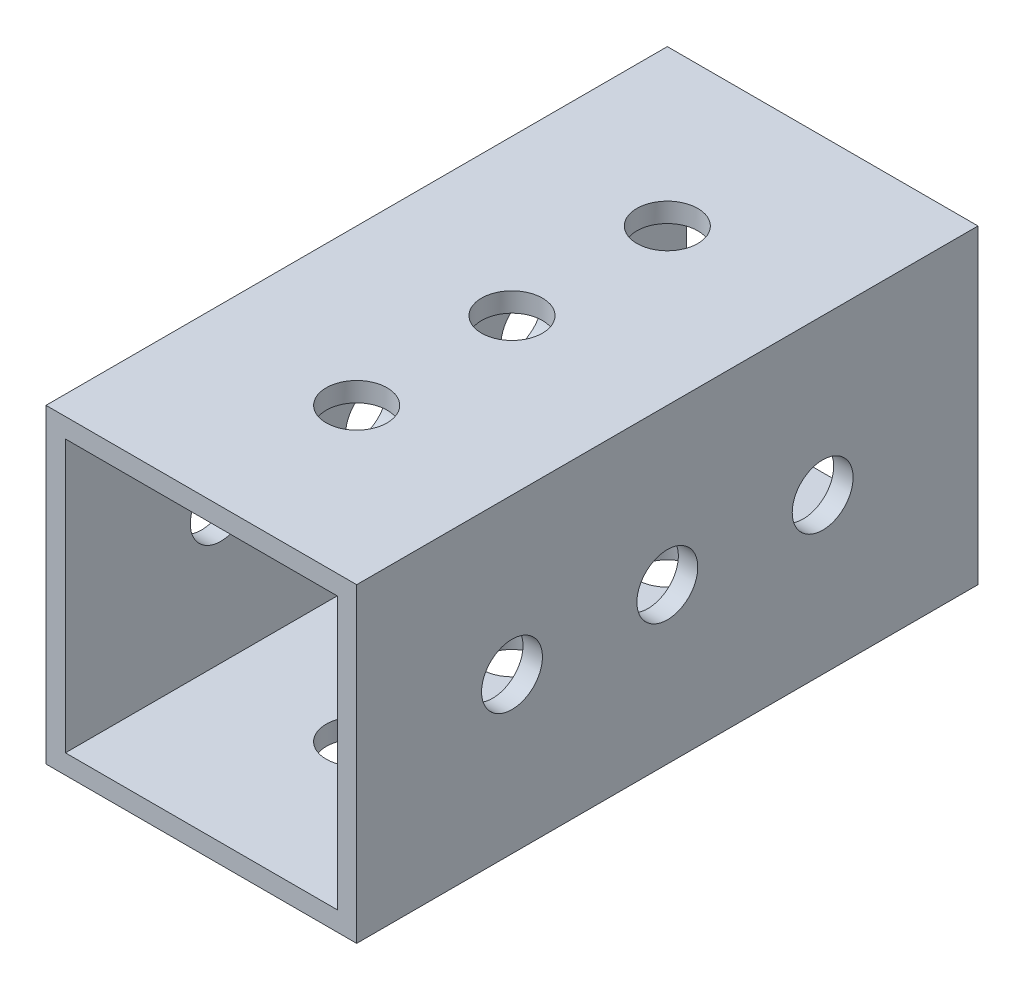
ISO-10303-21;
HEADER;
FILE_DESCRIPTION(('STEP AP214'),'2;1');
FILE_NAME('part.step','',(''),(''),'','','');
FILE_SCHEMA(('AUTOMOTIVE_DESIGN { 1 0 10303 214 1 1 1 1 }'));
ENDSEC;
DATA;
#1=APPLICATION_CONTEXT('core data for automotive mechanical design processes');
#2=APPLICATION_PROTOCOL_DEFINITION('international standard','automotive_design',2000,#1);
#3=PRODUCT_CONTEXT('',#1,'mechanical');
#4=PRODUCT('Part','Part','',(#3));
#5=PRODUCT_RELATED_PRODUCT_CATEGORY('part','',(#4));
#6=PRODUCT_DEFINITION_FORMATION('','',#4);
#7=PRODUCT_DEFINITION_CONTEXT('part definition',#1,'design');
#8=PRODUCT_DEFINITION('design','',#6,#7);
#9=PRODUCT_DEFINITION_SHAPE('','',#8);
#10=(LENGTH_UNIT() NAMED_UNIT(*) SI_UNIT(.MILLI.,.METRE.));
#11=(NAMED_UNIT(*) PLANE_ANGLE_UNIT() SI_UNIT($,.RADIAN.));
#12=(NAMED_UNIT(*) SI_UNIT($,.STERADIAN.) SOLID_ANGLE_UNIT());
#13=UNCERTAINTY_MEASURE_WITH_UNIT(LENGTH_MEASURE(1.E-05),#10,'distance_accuracy_value','');
#14=(GEOMETRIC_REPRESENTATION_CONTEXT(3) GLOBAL_UNCERTAINTY_ASSIGNED_CONTEXT((#13)) GLOBAL_UNIT_ASSIGNED_CONTEXT((#10,
#11,#12)) REPRESENTATION_CONTEXT('',''));
#15=CARTESIAN_POINT('',(0.,0.,0.));
#16=DIRECTION('',(0.,0.,1.));
#17=DIRECTION('',(1.,0.,0.));
#18=AXIS2_PLACEMENT_3D('',#15,#16,#17);
#19=CARTESIAN_POINT('',(0.,0.,50.8));
#20=DIRECTION('',(0.,0.,-1.));
#21=DIRECTION('',(-1.,0.,0.));
#22=AXIS2_PLACEMENT_3D('',#19,#20,#21);
#23=PLANE('',#22);
#24=DIRECTION('',(0.,-1.,0.));
#25=VECTOR('',#24,1.);
#26=CARTESIAN_POINT('',(0.,0.,50.8));
#27=LINE('',#26,#25);
#28=CARTESIAN_POINT('',(0.,25.4,50.8));
#29=VERTEX_POINT('',#28);
#30=CARTESIAN_POINT('',(0.,0.,50.8));
#31=VERTEX_POINT('',#30);
#32=EDGE_CURVE('E163',#29,#31,#27,.T.);
#33=ORIENTED_EDGE('',*,*,#32,.T.);
#34=DIRECTION('',(1.,0.,0.));
#35=VECTOR('',#34,1.);
#36=CARTESIAN_POINT('',(0.,0.,50.8));
#37=LINE('',#36,#35);
#38=CARTESIAN_POINT('',(25.4,0.,50.8));
#39=VERTEX_POINT('',#38);
#40=EDGE_CURVE('E167',#31,#39,#37,.T.);
#41=ORIENTED_EDGE('',*,*,#40,.T.);
#42=DIRECTION('',(0.,1.,0.));
#43=VECTOR('',#42,1.);
#44=CARTESIAN_POINT('',(25.4,0.,50.8));
#45=LINE('',#44,#43);
#46=CARTESIAN_POINT('',(25.4,25.4,50.8));
#47=VERTEX_POINT('',#46);
#48=EDGE_CURVE('E171',#39,#47,#45,.T.);
#49=ORIENTED_EDGE('',*,*,#48,.T.);
#50=DIRECTION('',(-1.,0.,0.));
#51=VECTOR('',#50,1.);
#52=CARTESIAN_POINT('',(0.,25.4,50.8));
#53=LINE('',#52,#51);
#54=EDGE_CURVE('E174',#47,#29,#53,.T.);
#55=ORIENTED_EDGE('',*,*,#54,.T.);
#56=EDGE_LOOP('',(#33,#41,#49,#55));
#57=FACE_BOUND('',#56,.T.);
#58=DIRECTION('',(0.,-1.,0.));
#59=VECTOR('',#58,1.);
#60=CARTESIAN_POINT('',(1.5875,1.5875,50.8));
#61=LINE('',#60,#59);
#62=CARTESIAN_POINT('',(1.5875,23.8125,50.8));
#63=VERTEX_POINT('',#62);
#64=CARTESIAN_POINT('',(1.5875,1.5875,50.8));
#65=VERTEX_POINT('',#64);
#66=EDGE_CURVE('E113',#63,#65,#61,.T.);
#67=ORIENTED_EDGE('',*,*,#66,.F.);
#68=DIRECTION('',(-1.,0.,0.));
#69=VECTOR('',#68,1.);
#70=CARTESIAN_POINT('',(1.5875,23.8125,50.8));
#71=LINE('',#70,#69);
#72=CARTESIAN_POINT('',(23.8125,23.8125,50.8));
#73=VERTEX_POINT('',#72);
#74=EDGE_CURVE('E139',#73,#63,#71,.T.);
#75=ORIENTED_EDGE('',*,*,#74,.F.);
#76=DIRECTION('',(0.,1.,0.));
#77=VECTOR('',#76,1.);
#78=CARTESIAN_POINT('',(23.8125,1.5875,50.8));
#79=LINE('',#78,#77);
#80=CARTESIAN_POINT('',(23.8125,1.5875,50.8));
#81=VERTEX_POINT('',#80);
#82=EDGE_CURVE('E135',#81,#73,#79,.T.);
#83=ORIENTED_EDGE('',*,*,#82,.F.);
#84=DIRECTION('',(1.,0.,0.));
#85=VECTOR('',#84,1.);
#86=CARTESIAN_POINT('',(1.5875,1.5875,50.8));
#87=LINE('',#86,#85);
#88=EDGE_CURVE('E122',#65,#81,#87,.T.);
#89=ORIENTED_EDGE('',*,*,#88,.F.);
#90=EDGE_LOOP('',(#67,#75,#83,#89));
#91=FACE_BOUND('',#90,.T.);
#92=ADVANCED_FACE('F45',(#57,#91),#23,.F.);
#93=CARTESIAN_POINT('',(0.,0.,0.));
#94=DIRECTION('',(0.,0.,-1.));
#95=DIRECTION('',(-1.,0.,0.));
#96=AXIS2_PLACEMENT_3D('',#93,#94,#95);
#97=PLANE('',#96);
#98=DIRECTION('',(0.,-1.,0.));
#99=VECTOR('',#98,1.);
#100=CARTESIAN_POINT('',(0.,0.,0.));
#101=LINE('',#100,#99);
#102=CARTESIAN_POINT('',(0.,25.4,0.));
#103=VERTEX_POINT('',#102);
#104=CARTESIAN_POINT('',(0.,0.,0.));
#105=VERTEX_POINT('',#104);
#106=EDGE_CURVE('E131',#103,#105,#101,.T.);
#107=ORIENTED_EDGE('',*,*,#106,.F.);
#108=DIRECTION('',(-1.,0.,0.));
#109=VECTOR('',#108,1.);
#110=CARTESIAN_POINT('',(0.,25.4,0.));
#111=LINE('',#110,#109);
#112=CARTESIAN_POINT('',(25.4,25.4,0.));
#113=VERTEX_POINT('',#112);
#114=EDGE_CURVE('E168',#113,#103,#111,.T.);
#115=ORIENTED_EDGE('',*,*,#114,.F.);
#116=DIRECTION('',(0.,1.,0.));
#117=VECTOR('',#116,1.);
#118=CARTESIAN_POINT('',(25.4,0.,0.));
#119=LINE('',#118,#117);
#120=CARTESIAN_POINT('',(25.4,0.,0.));
#121=VERTEX_POINT('',#120);
#122=EDGE_CURVE('E184',#121,#113,#119,.T.);
#123=ORIENTED_EDGE('',*,*,#122,.F.);
#124=DIRECTION('',(1.,0.,0.));
#125=VECTOR('',#124,1.);
#126=CARTESIAN_POINT('',(0.,0.,0.));
#127=LINE('',#126,#125);
#128=EDGE_CURVE('E181',#105,#121,#127,.T.);
#129=ORIENTED_EDGE('',*,*,#128,.F.);
#130=EDGE_LOOP('',(#107,#115,#123,#129));
#131=FACE_BOUND('',#130,.T.);
#132=DIRECTION('',(-1.,0.,0.));
#133=VECTOR('',#132,1.);
#134=CARTESIAN_POINT('',(1.5875,23.8125,0.));
#135=LINE('',#134,#133);
#136=CARTESIAN_POINT('',(23.8125,23.8125,0.));
#137=VERTEX_POINT('',#136);
#138=CARTESIAN_POINT('',(1.5875,23.8125,0.));
#139=VERTEX_POINT('',#138);
#140=EDGE_CURVE('E123',#137,#139,#135,.T.);
#141=ORIENTED_EDGE('',*,*,#140,.T.);
#142=DIRECTION('',(0.,-1.,0.));
#143=VECTOR('',#142,1.);
#144=CARTESIAN_POINT('',(1.5875,1.5875,0.));
#145=LINE('',#144,#143);
#146=CARTESIAN_POINT('',(1.5875,1.5875,0.));
#147=VERTEX_POINT('',#146);
#148=EDGE_CURVE('E71',#139,#147,#145,.T.);
#149=ORIENTED_EDGE('',*,*,#148,.T.);
#150=DIRECTION('',(1.,0.,0.));
#151=VECTOR('',#150,1.);
#152=CARTESIAN_POINT('',(1.5875,1.5875,0.));
#153=LINE('',#152,#151);
#154=CARTESIAN_POINT('',(23.8125,1.5875,0.));
#155=VERTEX_POINT('',#154);
#156=EDGE_CURVE('E129',#147,#155,#153,.T.);
#157=ORIENTED_EDGE('',*,*,#156,.T.);
#158=DIRECTION('',(0.,1.,0.));
#159=VECTOR('',#158,1.);
#160=CARTESIAN_POINT('',(23.8125,1.5875,0.));
#161=LINE('',#160,#159);
#162=EDGE_CURVE('E150',#155,#137,#161,.T.);
#163=ORIENTED_EDGE('',*,*,#162,.T.);
#164=EDGE_LOOP('',(#141,#149,#157,#163));
#165=FACE_BOUND('',#164,.T.);
#166=ADVANCED_FACE('F307',(#131,#165),#97,.T.);
#167=CARTESIAN_POINT('',(0.,0.,50.8));
#168=DIRECTION('',(1.,0.,0.));
#169=DIRECTION('',(0.,0.,-1.));
#170=AXIS2_PLACEMENT_3D('',#167,#168,#169);
#171=PLANE('',#170);
#172=CARTESIAN_POINT('',(0.,12.7,12.7));
#173=DIRECTION('',(-1.,0.,0.));
#174=DIRECTION('',(0.,0.,1.));
#175=AXIS2_PLACEMENT_3D('',#172,#173,#174);
#176=CIRCLE('',#175,2.4892);
#177=CARTESIAN_POINT('',(0.,12.7,15.1892));
#178=VERTEX_POINT('',#177);
#179=EDGE_CURVE('E356',#178,#178,#176,.T.);
#180=ORIENTED_EDGE('',*,*,#179,.F.);
#181=EDGE_LOOP('',(#180));
#182=FACE_BOUND('',#181,.T.);
#183=CARTESIAN_POINT('',(0.,12.7,25.4));
#184=DIRECTION('',(-1.,0.,0.));
#185=DIRECTION('',(0.,0.,1.));
#186=AXIS2_PLACEMENT_3D('',#183,#184,#185);
#187=CIRCLE('',#186,2.4892);
#188=CARTESIAN_POINT('',(0.,12.7,27.8892));
#189=VERTEX_POINT('',#188);
#190=EDGE_CURVE('E350',#189,#189,#187,.T.);
#191=ORIENTED_EDGE('',*,*,#190,.F.);
#192=EDGE_LOOP('',(#191));
#193=FACE_BOUND('',#192,.T.);
#194=CARTESIAN_POINT('',(0.,12.7,38.1));
#195=DIRECTION('',(-1.,0.,0.));
#196=DIRECTION('',(0.,0.,1.));
#197=AXIS2_PLACEMENT_3D('',#194,#195,#196);
#198=CIRCLE('',#197,2.4892);
#199=CARTESIAN_POINT('',(0.,12.7,40.5892));
#200=VERTEX_POINT('',#199);
#201=EDGE_CURVE('E344',#200,#200,#198,.T.);
#202=ORIENTED_EDGE('',*,*,#201,.F.);
#203=EDGE_LOOP('',(#202));
#204=FACE_BOUND('',#203,.T.);
#205=ORIENTED_EDGE('',*,*,#106,.T.);
#206=DIRECTION('',(0.,0.,-1.));
#207=VECTOR('',#206,1.);
#208=CARTESIAN_POINT('',(0.,0.,50.8));
#209=LINE('',#208,#207);
#210=EDGE_CURVE('E11',#31,#105,#209,.T.);
#211=ORIENTED_EDGE('',*,*,#210,.F.);
#212=ORIENTED_EDGE('',*,*,#32,.F.);
#213=DIRECTION('',(0.,0.,-1.));
#214=VECTOR('',#213,1.);
#215=CARTESIAN_POINT('',(0.,25.4,50.8));
#216=LINE('',#215,#214);
#217=EDGE_CURVE('E177',#29,#103,#216,.T.);
#218=ORIENTED_EDGE('',*,*,#217,.T.);
#219=EDGE_LOOP('',(#205,#211,#212,#218));
#220=FACE_BOUND('',#219,.T.);
#221=ADVANCED_FACE('F47',(#182,#193,#204,#220),#171,.F.);
#222=CARTESIAN_POINT('',(0.,0.,50.8));
#223=DIRECTION('',(0.,1.,0.));
#224=DIRECTION('',(0.,0.,1.));
#225=AXIS2_PLACEMENT_3D('',#222,#223,#224);
#226=PLANE('',#225);
#227=CARTESIAN_POINT('',(12.7,0.,12.7));
#228=DIRECTION('',(0.,1.,0.));
#229=DIRECTION('',(0.,0.,1.));
#230=AXIS2_PLACEMENT_3D('',#227,#228,#229);
#231=CIRCLE('',#230,2.4892);
#232=CARTESIAN_POINT('',(12.7,0.,15.1892));
#233=VERTEX_POINT('',#232);
#234=EDGE_CURVE('E204',#233,#233,#231,.T.);
#235=ORIENTED_EDGE('',*,*,#234,.T.);
#236=EDGE_LOOP('',(#235));
#237=FACE_BOUND('',#236,.T.);
#238=CARTESIAN_POINT('',(12.7000000000001,0.,25.4));
#239=DIRECTION('',(0.,1.,0.));
#240=DIRECTION('',(0.,0.,1.));
#241=AXIS2_PLACEMENT_3D('',#238,#239,#240);
#242=CIRCLE('',#241,2.4892);
#243=CARTESIAN_POINT('',(12.7000000000001,0.,27.8892));
#244=VERTEX_POINT('',#243);
#245=EDGE_CURVE('E253',#244,#244,#242,.T.);
#246=ORIENTED_EDGE('',*,*,#245,.T.);
#247=EDGE_LOOP('',(#246));
#248=FACE_BOUND('',#247,.T.);
#249=CARTESIAN_POINT('',(12.7000000000003,0.,38.1));
#250=DIRECTION('',(0.,1.,0.));
#251=DIRECTION('',(0.,0.,1.));
#252=AXIS2_PLACEMENT_3D('',#249,#250,#251);
#253=CIRCLE('',#252,2.4892);
#254=CARTESIAN_POINT('',(12.7000000000003,0.,40.5892));
#255=VERTEX_POINT('',#254);
#256=EDGE_CURVE('E241',#255,#255,#253,.T.);
#257=ORIENTED_EDGE('',*,*,#256,.T.);
#258=EDGE_LOOP('',(#257));
#259=FACE_BOUND('',#258,.T.);
#260=ORIENTED_EDGE('',*,*,#128,.T.);
#261=DIRECTION('',(0.,0.,-1.));
#262=VECTOR('',#261,1.);
#263=CARTESIAN_POINT('',(25.4,0.,50.8));
#264=LINE('',#263,#262);
#265=EDGE_CURVE('E55',#39,#121,#264,.T.);
#266=ORIENTED_EDGE('',*,*,#265,.F.);
#267=ORIENTED_EDGE('',*,*,#40,.F.);
#268=ORIENTED_EDGE('',*,*,#210,.T.);
#269=EDGE_LOOP('',(#260,#266,#267,#268));
#270=FACE_BOUND('',#269,.T.);
#271=ADVANCED_FACE('F293',(#237,#248,#259,#270),#226,.F.);
#272=CARTESIAN_POINT('',(25.4,0.,50.8));
#273=DIRECTION('',(-1.,0.,0.));
#274=DIRECTION('',(0.,0.,1.));
#275=AXIS2_PLACEMENT_3D('',#272,#273,#274);
#276=PLANE('',#275);
#277=CARTESIAN_POINT('',(25.4,12.7,12.7));
#278=DIRECTION('',(-1.,0.,0.));
#279=DIRECTION('',(0.,0.,1.));
#280=AXIS2_PLACEMENT_3D('',#277,#278,#279);
#281=CIRCLE('',#280,2.4892);
#282=CARTESIAN_POINT('',(25.4,12.7,15.1892));
#283=VERTEX_POINT('',#282);
#284=EDGE_CURVE('E218',#283,#283,#281,.T.);
#285=ORIENTED_EDGE('',*,*,#284,.T.);
#286=EDGE_LOOP('',(#285));
#287=FACE_BOUND('',#286,.T.);
#288=CARTESIAN_POINT('',(25.4,12.7,25.4));
#289=DIRECTION('',(-1.,0.,0.));
#290=DIRECTION('',(0.,0.,1.));
#291=AXIS2_PLACEMENT_3D('',#288,#289,#290);
#292=CIRCLE('',#291,2.4892);
#293=CARTESIAN_POINT('',(25.4,12.7,27.8892));
#294=VERTEX_POINT('',#293);
#295=EDGE_CURVE('E339',#294,#294,#292,.T.);
#296=ORIENTED_EDGE('',*,*,#295,.T.);
#297=EDGE_LOOP('',(#296));
#298=FACE_BOUND('',#297,.T.);
#299=CARTESIAN_POINT('',(25.4,12.7,38.1));
#300=DIRECTION('',(-1.,0.,0.));
#301=DIRECTION('',(0.,0.,1.));
#302=AXIS2_PLACEMENT_3D('',#299,#300,#301);
#303=CIRCLE('',#302,2.4892);
#304=CARTESIAN_POINT('',(25.4,12.7,40.5892));
#305=VERTEX_POINT('',#304);
#306=EDGE_CURVE('E234',#305,#305,#303,.T.);
#307=ORIENTED_EDGE('',*,*,#306,.T.);
#308=EDGE_LOOP('',(#307));
#309=FACE_BOUND('',#308,.T.);
#310=ORIENTED_EDGE('',*,*,#122,.T.);
#311=DIRECTION('',(0.,0.,-1.));
#312=VECTOR('',#311,1.);
#313=CARTESIAN_POINT('',(25.4,25.4,50.8));
#314=LINE('',#313,#312);
#315=EDGE_CURVE('E192',#47,#113,#314,.T.);
#316=ORIENTED_EDGE('',*,*,#315,.F.);
#317=ORIENTED_EDGE('',*,*,#48,.F.);
#318=ORIENTED_EDGE('',*,*,#265,.T.);
#319=EDGE_LOOP('',(#310,#316,#317,#318));
#320=FACE_BOUND('',#319,.T.);
#321=ADVANCED_FACE('F296',(#287,#298,#309,#320),#276,.F.);
#322=CARTESIAN_POINT('',(0.,25.4,50.8));
#323=DIRECTION('',(0.,-1.,0.));
#324=DIRECTION('',(0.,0.,-1.));
#325=AXIS2_PLACEMENT_3D('',#322,#323,#324);
#326=PLANE('',#325);
#327=CARTESIAN_POINT('',(12.7,25.4,12.7));
#328=DIRECTION('',(0.,1.,0.));
#329=DIRECTION('',(0.,0.,1.));
#330=AXIS2_PLACEMENT_3D('',#327,#328,#329);
#331=CIRCLE('',#330,2.4892);
#332=CARTESIAN_POINT('',(12.7,25.4,15.1892));
#333=VERTEX_POINT('',#332);
#334=EDGE_CURVE('E245',#333,#333,#331,.T.);
#335=ORIENTED_EDGE('',*,*,#334,.F.);
#336=EDGE_LOOP('',(#335));
#337=FACE_BOUND('',#336,.T.);
#338=CARTESIAN_POINT('',(12.7000000000001,25.4,25.4));
#339=DIRECTION('',(0.,1.,0.));
#340=DIRECTION('',(0.,0.,1.));
#341=AXIS2_PLACEMENT_3D('',#338,#339,#340);
#342=CIRCLE('',#341,2.4892);
#343=CARTESIAN_POINT('',(12.7000000000001,25.4,27.8892));
#344=VERTEX_POINT('',#343);
#345=EDGE_CURVE('E249',#344,#344,#342,.T.);
#346=ORIENTED_EDGE('',*,*,#345,.F.);
#347=EDGE_LOOP('',(#346));
#348=FACE_BOUND('',#347,.T.);
#349=CARTESIAN_POINT('',(12.7000000000003,25.4,38.1));
#350=DIRECTION('',(0.,1.,0.));
#351=DIRECTION('',(0.,0.,1.));
#352=AXIS2_PLACEMENT_3D('',#349,#350,#351);
#353=CIRCLE('',#352,2.4892);
#354=CARTESIAN_POINT('',(12.7000000000003,25.4,40.5892));
#355=VERTEX_POINT('',#354);
#356=EDGE_CURVE('E257',#355,#355,#353,.T.);
#357=ORIENTED_EDGE('',*,*,#356,.F.);
#358=EDGE_LOOP('',(#357));
#359=FACE_BOUND('',#358,.T.);
#360=ORIENTED_EDGE('',*,*,#114,.T.);
#361=ORIENTED_EDGE('',*,*,#217,.F.);
#362=ORIENTED_EDGE('',*,*,#54,.F.);
#363=ORIENTED_EDGE('',*,*,#315,.T.);
#364=EDGE_LOOP('',(#360,#361,#362,#363));
#365=FACE_BOUND('',#364,.T.);
#366=ADVANCED_FACE('F311',(#337,#348,#359,#365),#326,.F.);
#367=CARTESIAN_POINT('',(1.5875,1.5875,50.8));
#368=DIRECTION('',(1.,0.,0.));
#369=DIRECTION('',(0.,0.,-1.));
#370=AXIS2_PLACEMENT_3D('',#367,#368,#369);
#371=PLANE('',#370);
#372=CARTESIAN_POINT('',(1.5875,12.7,12.7));
#373=DIRECTION('',(1.,0.,0.));
#374=DIRECTION('',(0.,0.,-1.));
#375=AXIS2_PLACEMENT_3D('',#372,#373,#374);
#376=CIRCLE('',#375,2.4892);
#377=CARTESIAN_POINT('',(1.5875,12.7,10.2108));
#378=VERTEX_POINT('',#377);
#379=EDGE_CURVE('E237',#378,#378,#376,.T.);
#380=ORIENTED_EDGE('',*,*,#379,.F.);
#381=EDGE_LOOP('',(#380));
#382=FACE_BOUND('',#381,.T.);
#383=CARTESIAN_POINT('',(1.5875,12.7,25.4));
#384=DIRECTION('',(1.,0.,0.));
#385=DIRECTION('',(0.,0.,-1.));
#386=AXIS2_PLACEMENT_3D('',#383,#384,#385);
#387=CIRCLE('',#386,2.4892);
#388=CARTESIAN_POINT('',(1.5875,12.7,22.9108));
#389=VERTEX_POINT('',#388);
#390=EDGE_CURVE('E222',#389,#389,#387,.T.);
#391=ORIENTED_EDGE('',*,*,#390,.F.);
#392=EDGE_LOOP('',(#391));
#393=FACE_BOUND('',#392,.T.);
#394=CARTESIAN_POINT('',(1.5875,12.7,38.1));
#395=DIRECTION('',(1.,0.,0.));
#396=DIRECTION('',(0.,0.,-1.));
#397=AXIS2_PLACEMENT_3D('',#394,#395,#396);
#398=CIRCLE('',#397,2.4892);
#399=CARTESIAN_POINT('',(1.5875,12.7,35.6108));
#400=VERTEX_POINT('',#399);
#401=EDGE_CURVE('E217',#400,#400,#398,.T.);
#402=ORIENTED_EDGE('',*,*,#401,.F.);
#403=EDGE_LOOP('',(#402));
#404=FACE_BOUND('',#403,.T.);
#405=ORIENTED_EDGE('',*,*,#148,.F.);
#406=DIRECTION('',(0.,0.,-1.));
#407=VECTOR('',#406,1.);
#408=CARTESIAN_POINT('',(1.5875,23.8125,50.8));
#409=LINE('',#408,#407);
#410=EDGE_CURVE('E117',#63,#139,#409,.T.);
#411=ORIENTED_EDGE('',*,*,#410,.F.);
#412=ORIENTED_EDGE('',*,*,#66,.T.);
#413=DIRECTION('',(0.,0.,-1.));
#414=VECTOR('',#413,1.);
#415=CARTESIAN_POINT('',(1.5875,1.5875,50.8));
#416=LINE('',#415,#414);
#417=EDGE_CURVE('E116',#65,#147,#416,.T.);
#418=ORIENTED_EDGE('',*,*,#417,.T.);
#419=EDGE_LOOP('',(#405,#411,#412,#418));
#420=FACE_BOUND('',#419,.T.);
#421=ADVANCED_FACE('F115',(#382,#393,#404,#420),#371,.T.);
#422=CARTESIAN_POINT('',(1.5875,1.5875,50.8));
#423=DIRECTION('',(0.,1.,0.));
#424=DIRECTION('',(0.,0.,1.));
#425=AXIS2_PLACEMENT_3D('',#422,#423,#424);
#426=PLANE('',#425);
#427=CARTESIAN_POINT('',(12.7,1.5875,12.7));
#428=DIRECTION('',(0.,1.,0.));
#429=DIRECTION('',(0.,0.,1.));
#430=AXIS2_PLACEMENT_3D('',#427,#428,#429);
#431=CIRCLE('',#430,2.4892);
#432=CARTESIAN_POINT('',(12.7,1.5875,15.1892));
#433=VERTEX_POINT('',#432);
#434=EDGE_CURVE('E147',#433,#433,#431,.T.);
#435=ORIENTED_EDGE('',*,*,#434,.F.);
#436=EDGE_LOOP('',(#435));
#437=FACE_BOUND('',#436,.T.);
#438=CARTESIAN_POINT('',(12.7000000000001,1.5875,25.4));
#439=DIRECTION('',(0.,1.,0.));
#440=DIRECTION('',(0.,0.,1.));
#441=AXIS2_PLACEMENT_3D('',#438,#439,#440);
#442=CIRCLE('',#441,2.4892);
#443=CARTESIAN_POINT('',(12.7000000000001,1.5875,27.8892));
#444=VERTEX_POINT('',#443);
#445=EDGE_CURVE('E209',#444,#444,#442,.T.);
#446=ORIENTED_EDGE('',*,*,#445,.F.);
#447=EDGE_LOOP('',(#446));
#448=FACE_BOUND('',#447,.T.);
#449=CARTESIAN_POINT('',(12.7000000000003,1.5875,38.1));
#450=DIRECTION('',(0.,1.,0.));
#451=DIRECTION('',(0.,0.,1.));
#452=AXIS2_PLACEMENT_3D('',#449,#450,#451);
#453=CIRCLE('',#452,2.4892);
#454=CARTESIAN_POINT('',(12.7000000000003,1.5875,40.5892));
#455=VERTEX_POINT('',#454);
#456=EDGE_CURVE('E203',#455,#455,#453,.T.);
#457=ORIENTED_EDGE('',*,*,#456,.F.);
#458=EDGE_LOOP('',(#457));
#459=FACE_BOUND('',#458,.T.);
#460=ORIENTED_EDGE('',*,*,#156,.F.);
#461=ORIENTED_EDGE('',*,*,#417,.F.);
#462=ORIENTED_EDGE('',*,*,#88,.T.);
#463=DIRECTION('',(0.,0.,-1.));
#464=VECTOR('',#463,1.);
#465=CARTESIAN_POINT('',(23.8125,1.5875,50.8));
#466=LINE('',#465,#464);
#467=EDGE_CURVE('E132',#81,#155,#466,.T.);
#468=ORIENTED_EDGE('',*,*,#467,.T.);
#469=EDGE_LOOP('',(#460,#461,#462,#468));
#470=FACE_BOUND('',#469,.T.);
#471=ADVANCED_FACE('F126',(#437,#448,#459,#470),#426,.T.);
#472=CARTESIAN_POINT('',(23.8125,1.5875,50.8));
#473=DIRECTION('',(-1.,0.,0.));
#474=DIRECTION('',(0.,0.,1.));
#475=AXIS2_PLACEMENT_3D('',#472,#473,#474);
#476=PLANE('',#475);
#477=CARTESIAN_POINT('',(23.8125,12.7,12.7));
#478=DIRECTION('',(-1.,0.,0.));
#479=DIRECTION('',(0.,0.,1.));
#480=AXIS2_PLACEMENT_3D('',#477,#478,#479);
#481=CIRCLE('',#480,2.4892);
#482=CARTESIAN_POINT('',(23.8125,12.7,15.1892));
#483=VERTEX_POINT('',#482);
#484=EDGE_CURVE('E49',#483,#483,#481,.T.);
#485=ORIENTED_EDGE('',*,*,#484,.F.);
#486=EDGE_LOOP('',(#485));
#487=FACE_BOUND('',#486,.T.);
#488=CARTESIAN_POINT('',(23.8125,12.7,25.4));
#489=DIRECTION('',(-1.,0.,0.));
#490=DIRECTION('',(0.,0.,1.));
#491=AXIS2_PLACEMENT_3D('',#488,#489,#490);
#492=CIRCLE('',#491,2.4892);
#493=CARTESIAN_POINT('',(23.8125,12.7,27.8892));
#494=VERTEX_POINT('',#493);
#495=EDGE_CURVE('E219',#494,#494,#492,.T.);
#496=ORIENTED_EDGE('',*,*,#495,.F.);
#497=EDGE_LOOP('',(#496));
#498=FACE_BOUND('',#497,.T.);
#499=CARTESIAN_POINT('',(23.8125,12.7,38.1));
#500=DIRECTION('',(-1.,0.,0.));
#501=DIRECTION('',(0.,0.,1.));
#502=AXIS2_PLACEMENT_3D('',#499,#500,#501);
#503=CIRCLE('',#502,2.4892);
#504=CARTESIAN_POINT('',(23.8125,12.7,40.5892));
#505=VERTEX_POINT('',#504);
#506=EDGE_CURVE('E214',#505,#505,#503,.T.);
#507=ORIENTED_EDGE('',*,*,#506,.F.);
#508=EDGE_LOOP('',(#507));
#509=FACE_BOUND('',#508,.T.);
#510=ORIENTED_EDGE('',*,*,#162,.F.);
#511=ORIENTED_EDGE('',*,*,#467,.F.);
#512=ORIENTED_EDGE('',*,*,#82,.T.);
#513=DIRECTION('',(0.,0.,-1.));
#514=VECTOR('',#513,1.);
#515=CARTESIAN_POINT('',(23.8125,23.8125,50.8));
#516=LINE('',#515,#514);
#517=EDGE_CURVE('E63',#73,#137,#516,.T.);
#518=ORIENTED_EDGE('',*,*,#517,.T.);
#519=EDGE_LOOP('',(#510,#511,#512,#518));
#520=FACE_BOUND('',#519,.T.);
#521=ADVANCED_FACE('F278',(#487,#498,#509,#520),#476,.T.);
#522=CARTESIAN_POINT('',(1.5875,23.8125,50.8));
#523=DIRECTION('',(0.,-1.,0.));
#524=DIRECTION('',(0.,0.,-1.));
#525=AXIS2_PLACEMENT_3D('',#522,#523,#524);
#526=PLANE('',#525);
#527=CARTESIAN_POINT('',(12.7,23.8125,12.7));
#528=DIRECTION('',(0.,-1.,0.));
#529=DIRECTION('',(0.,0.,-1.));
#530=AXIS2_PLACEMENT_3D('',#527,#528,#529);
#531=CIRCLE('',#530,2.4892);
#532=CARTESIAN_POINT('',(12.7,23.8125,10.2108));
#533=VERTEX_POINT('',#532);
#534=EDGE_CURVE('E210',#533,#533,#531,.T.);
#535=ORIENTED_EDGE('',*,*,#534,.F.);
#536=EDGE_LOOP('',(#535));
#537=FACE_BOUND('',#536,.T.);
#538=CARTESIAN_POINT('',(12.7000000000001,23.8125,25.4));
#539=DIRECTION('',(0.,-1.,0.));
#540=DIRECTION('',(0.,0.,-1.));
#541=AXIS2_PLACEMENT_3D('',#538,#539,#540);
#542=CIRCLE('',#541,2.4892);
#543=CARTESIAN_POINT('',(12.7000000000001,23.8125,22.9108));
#544=VERTEX_POINT('',#543);
#545=EDGE_CURVE('E205',#544,#544,#542,.T.);
#546=ORIENTED_EDGE('',*,*,#545,.F.);
#547=EDGE_LOOP('',(#546));
#548=FACE_BOUND('',#547,.T.);
#549=CARTESIAN_POINT('',(12.7000000000003,23.8125,38.1));
#550=DIRECTION('',(0.,-1.,0.));
#551=DIRECTION('',(0.,0.,-1.));
#552=AXIS2_PLACEMENT_3D('',#549,#550,#551);
#553=CIRCLE('',#552,2.4892);
#554=CARTESIAN_POINT('',(12.7000000000003,23.8125,35.6108));
#555=VERTEX_POINT('',#554);
#556=EDGE_CURVE('E199',#555,#555,#553,.T.);
#557=ORIENTED_EDGE('',*,*,#556,.F.);
#558=EDGE_LOOP('',(#557));
#559=FACE_BOUND('',#558,.T.);
#560=ORIENTED_EDGE('',*,*,#140,.F.);
#561=ORIENTED_EDGE('',*,*,#517,.F.);
#562=ORIENTED_EDGE('',*,*,#74,.T.);
#563=ORIENTED_EDGE('',*,*,#410,.T.);
#564=EDGE_LOOP('',(#560,#561,#562,#563));
#565=FACE_BOUND('',#564,.T.);
#566=ADVANCED_FACE('F405',(#537,#548,#559,#565),#526,.T.);
#567=CARTESIAN_POINT('',(12.7000000000003,0.,38.1));
#568=DIRECTION('',(0.,1.,0.));
#569=DIRECTION('',(0.,0.,1.));
#570=AXIS2_PLACEMENT_3D('',#567,#568,#569);
#571=CYLINDRICAL_SURFACE('',#570,2.4892);
#572=ORIENTED_EDGE('',*,*,#556,.T.);
#573=EDGE_LOOP('',(#572));
#574=FACE_BOUND('',#573,.T.);
#575=ORIENTED_EDGE('',*,*,#356,.T.);
#576=EDGE_LOOP('',(#575));
#577=FACE_BOUND('',#576,.T.);
#578=ADVANCED_FACE('F290',(#574,#577),#571,.F.);
#579=CARTESIAN_POINT('',(12.7000000000001,0.,25.4));
#580=DIRECTION('',(0.,1.,0.));
#581=DIRECTION('',(0.,0.,1.));
#582=AXIS2_PLACEMENT_3D('',#579,#580,#581);
#583=CYLINDRICAL_SURFACE('',#582,2.4892);
#584=ORIENTED_EDGE('',*,*,#545,.T.);
#585=EDGE_LOOP('',(#584));
#586=FACE_BOUND('',#585,.T.);
#587=ORIENTED_EDGE('',*,*,#345,.T.);
#588=EDGE_LOOP('',(#587));
#589=FACE_BOUND('',#588,.T.);
#590=ADVANCED_FACE('F399',(#586,#589),#583,.F.);
#591=CARTESIAN_POINT('',(12.7,0.,12.7));
#592=DIRECTION('',(0.,1.,0.));
#593=DIRECTION('',(0.,0.,1.));
#594=AXIS2_PLACEMENT_3D('',#591,#592,#593);
#595=CYLINDRICAL_SURFACE('',#594,2.4892);
#596=ORIENTED_EDGE('',*,*,#534,.T.);
#597=EDGE_LOOP('',(#596));
#598=FACE_BOUND('',#597,.T.);
#599=ORIENTED_EDGE('',*,*,#334,.T.);
#600=EDGE_LOOP('',(#599));
#601=FACE_BOUND('',#600,.T.);
#602=ADVANCED_FACE('F288',(#598,#601),#595,.F.);
#603=ORIENTED_EDGE('',*,*,#456,.T.);
#604=EDGE_LOOP('',(#603));
#605=FACE_BOUND('',#604,.T.);
#606=ORIENTED_EDGE('',*,*,#256,.F.);
#607=EDGE_LOOP('',(#606));
#608=FACE_BOUND('',#607,.T.);
#609=ADVANCED_FACE('F284',(#605,#608),#571,.F.);
#610=ORIENTED_EDGE('',*,*,#445,.T.);
#611=EDGE_LOOP('',(#610));
#612=FACE_BOUND('',#611,.T.);
#613=ORIENTED_EDGE('',*,*,#245,.F.);
#614=EDGE_LOOP('',(#613));
#615=FACE_BOUND('',#614,.T.);
#616=ADVANCED_FACE('F287',(#612,#615),#583,.F.);
#617=ORIENTED_EDGE('',*,*,#434,.T.);
#618=EDGE_LOOP('',(#617));
#619=FACE_BOUND('',#618,.T.);
#620=ORIENTED_EDGE('',*,*,#234,.F.);
#621=EDGE_LOOP('',(#620));
#622=FACE_BOUND('',#621,.T.);
#623=ADVANCED_FACE('F273',(#619,#622),#595,.F.);
#624=CARTESIAN_POINT('',(25.4,12.7,38.1));
#625=DIRECTION('',(-1.,0.,0.));
#626=DIRECTION('',(0.,0.,1.));
#627=AXIS2_PLACEMENT_3D('',#624,#625,#626);
#628=CYLINDRICAL_SURFACE('',#627,2.4892);
#629=ORIENTED_EDGE('',*,*,#506,.T.);
#630=EDGE_LOOP('',(#629));
#631=FACE_BOUND('',#630,.T.);
#632=ORIENTED_EDGE('',*,*,#306,.F.);
#633=EDGE_LOOP('',(#632));
#634=FACE_BOUND('',#633,.T.);
#635=ADVANCED_FACE('F383',(#631,#634),#628,.F.);
#636=CARTESIAN_POINT('',(25.4,12.7,25.4));
#637=DIRECTION('',(-1.,0.,0.));
#638=DIRECTION('',(0.,0.,1.));
#639=AXIS2_PLACEMENT_3D('',#636,#637,#638);
#640=CYLINDRICAL_SURFACE('',#639,2.4892);
#641=ORIENTED_EDGE('',*,*,#495,.T.);
#642=EDGE_LOOP('',(#641));
#643=FACE_BOUND('',#642,.T.);
#644=ORIENTED_EDGE('',*,*,#295,.F.);
#645=EDGE_LOOP('',(#644));
#646=FACE_BOUND('',#645,.T.);
#647=ADVANCED_FACE('F374',(#643,#646),#640,.F.);
#648=CARTESIAN_POINT('',(25.4,12.7,12.7));
#649=DIRECTION('',(-1.,0.,0.));
#650=DIRECTION('',(0.,0.,1.));
#651=AXIS2_PLACEMENT_3D('',#648,#649,#650);
#652=CYLINDRICAL_SURFACE('',#651,2.4892);
#653=ORIENTED_EDGE('',*,*,#484,.T.);
#654=EDGE_LOOP('',(#653));
#655=FACE_BOUND('',#654,.T.);
#656=ORIENTED_EDGE('',*,*,#284,.F.);
#657=EDGE_LOOP('',(#656));
#658=FACE_BOUND('',#657,.T.);
#659=ADVANCED_FACE('F381',(#655,#658),#652,.F.);
#660=ORIENTED_EDGE('',*,*,#401,.T.);
#661=EDGE_LOOP('',(#660));
#662=FACE_BOUND('',#661,.T.);
#663=ORIENTED_EDGE('',*,*,#201,.T.);
#664=EDGE_LOOP('',(#663));
#665=FACE_BOUND('',#664,.T.);
#666=ADVANCED_FACE('F371',(#662,#665),#628,.F.);
#667=ORIENTED_EDGE('',*,*,#390,.T.);
#668=EDGE_LOOP('',(#667));
#669=FACE_BOUND('',#668,.T.);
#670=ORIENTED_EDGE('',*,*,#190,.T.);
#671=EDGE_LOOP('',(#670));
#672=FACE_BOUND('',#671,.T.);
#673=ADVANCED_FACE('F369',(#669,#672),#640,.F.);
#674=ORIENTED_EDGE('',*,*,#379,.T.);
#675=EDGE_LOOP('',(#674));
#676=FACE_BOUND('',#675,.T.);
#677=ORIENTED_EDGE('',*,*,#179,.T.);
#678=EDGE_LOOP('',(#677));
#679=FACE_BOUND('',#678,.T.);
#680=ADVANCED_FACE('F363',(#676,#679),#652,.F.);
#681=CLOSED_SHELL('',(#92,#166,#221,#271,#321,#366,#421,#471,#521,#566,#578,#590,#602,#609,#616,
#623,#635,#647,#659,#666,#673,#680));
#682=MANIFOLD_SOLID_BREP('B2',#681);
#683=ADVANCED_BREP_SHAPE_REPRESENTATION('',(#18,#682),#14);
#684=SHAPE_DEFINITION_REPRESENTATION(#9,#683);
ENDSEC;
END-ISO-10303-21;
